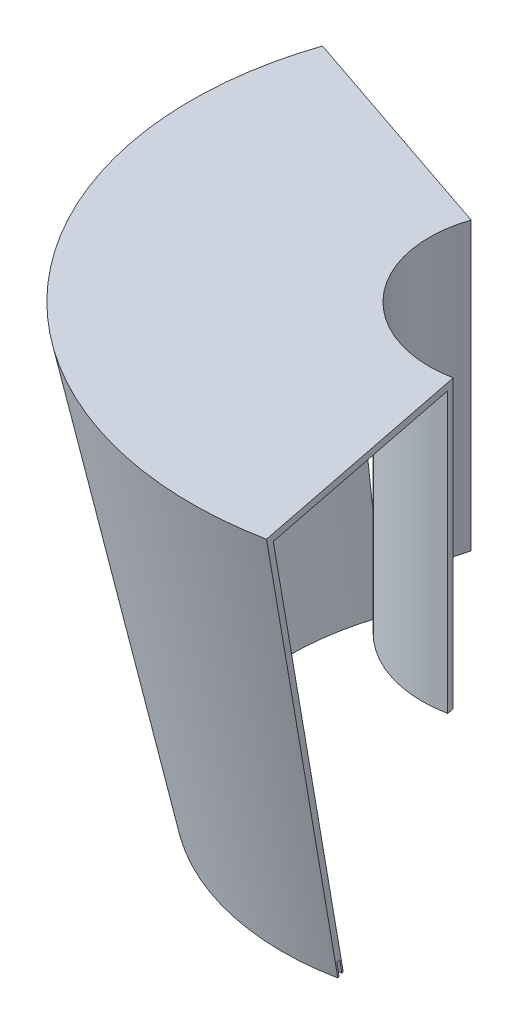
ISO-10303-21;
HEADER;
FILE_DESCRIPTION(('STEP AP214'),'2;1');
FILE_NAME('part.step','',(''),(''),'','','');
FILE_SCHEMA(('AUTOMOTIVE_DESIGN { 1 0 10303 214 1 1 1 1 }'));
ENDSEC;
DATA;
#1=APPLICATION_CONTEXT('core data for automotive mechanical design processes');
#2=APPLICATION_PROTOCOL_DEFINITION('international standard','automotive_design',2000,#1);
#3=PRODUCT_CONTEXT('',#1,'mechanical');
#4=PRODUCT('Part','Part','',(#3));
#5=PRODUCT_RELATED_PRODUCT_CATEGORY('part','',(#4));
#6=PRODUCT_DEFINITION_FORMATION('','',#4);
#7=PRODUCT_DEFINITION_CONTEXT('part definition',#1,'design');
#8=PRODUCT_DEFINITION('design','',#6,#7);
#9=PRODUCT_DEFINITION_SHAPE('','',#8);
#10=(LENGTH_UNIT() NAMED_UNIT(*) SI_UNIT(.MILLI.,.METRE.));
#11=(NAMED_UNIT(*) PLANE_ANGLE_UNIT() SI_UNIT($,.RADIAN.));
#12=(NAMED_UNIT(*) SI_UNIT($,.STERADIAN.) SOLID_ANGLE_UNIT());
#13=UNCERTAINTY_MEASURE_WITH_UNIT(LENGTH_MEASURE(1.E-05),#10,'distance_accuracy_value','');
#14=(GEOMETRIC_REPRESENTATION_CONTEXT(3) GLOBAL_UNCERTAINTY_ASSIGNED_CONTEXT((#13)) GLOBAL_UNIT_ASSIGNED_CONTEXT((#10,
#11,#12)) REPRESENTATION_CONTEXT('',''));
#15=CARTESIAN_POINT('',(0.,0.,0.));
#16=DIRECTION('',(0.,0.,1.));
#17=DIRECTION('',(1.,0.,0.));
#18=AXIS2_PLACEMENT_3D('',#15,#16,#17);
#19=CARTESIAN_POINT('',(0.,273.05,0.));
#20=DIRECTION('',(0.,-1.,0.));
#21=DIRECTION('',(0.,0.,-1.));
#22=AXIS2_PLACEMENT_3D('',#19,#20,#21);
#23=CONICAL_SURFACE('',#22,117.517905405405,1.36432189836919);
#24=DIRECTION('',(0.926817120685938,0.205010493456545,0.314612018804322));
#25=VECTOR('',#24,1.);
#26=CARTESIAN_POINT('',(0.,297.665236943026,0.));
#27=LINE('',#26,#25);
#28=CARTESIAN_POINT('',(-110.54558429399,273.212727079181,-37.5251693871339));
#29=VERTEX_POINT('',#28);
#30=CARTESIAN_POINT('',(-111.281245383534,273.05,-37.7748926770599));
#31=VERTEX_POINT('',#30);
#32=EDGE_CURVE('E11',#29,#31,#27,.F.);
#33=ORIENTED_EDGE('',*,*,#32,.F.);
#34=CARTESIAN_POINT('',(0.,273.212727079181,0.));
#35=DIRECTION('',(0.,-1.,0.));
#36=DIRECTION('',(0.,0.,-1.));
#37=AXIS2_PLACEMENT_3D('',#34,#35,#36);
#38=CIRCLE('',#37,116.741014833831);
#39=CARTESIAN_POINT('',(22.7750421764218,273.212727079181,114.497868968357));
#40=VERTEX_POINT('',#39);
#41=EDGE_CURVE('E138',#40,#29,#38,.T.);
#42=ORIENTED_EDGE('',*,*,#41,.F.);
#43=DIRECTION('',(-0.190946559722509,0.205010493456545,-0.959953180578534));
#44=VECTOR('',#43,1.);
#45=CARTESIAN_POINT('',(0.,297.665236943026,0.));
#46=LINE('',#45,#44);
#47=CARTESIAN_POINT('',(22.9266060082015,273.05,115.259831805441));
#48=VERTEX_POINT('',#47);
#49=EDGE_CURVE('E44',#40,#48,#46,.F.);
#50=ORIENTED_EDGE('',*,*,#49,.T.);
#51=CARTESIAN_POINT('',(0.,273.05,0.));
#52=DIRECTION('',(0.,-1.,0.));
#53=DIRECTION('',(0.,0.,-1.));
#54=AXIS2_PLACEMENT_3D('',#51,#52,#53);
#55=CIRCLE('',#54,117.517905405405);
#56=EDGE_CURVE('E132',#48,#31,#55,.T.);
#57=ORIENTED_EDGE('',*,*,#56,.T.);
#58=EDGE_LOOP('',(#33,#42,#50,#57));
#59=FACE_BOUND('',#58,.T.);
#60=ADVANCED_FACE('F36',(#59),#23,.F.);
#61=CARTESIAN_POINT('',(0.,273.212727079181,0.));
#62=DIRECTION('',(0.,1.,0.));
#63=DIRECTION('',(0.,0.,1.));
#64=AXIS2_PLACEMENT_3D('',#61,#62,#63);
#65=CONICAL_SURFACE('',#64,116.741014833831,0.20647442842569);
#66=DIRECTION('',(-0.19413061311665,0.978759775211829,-0.0658984633982029));
#67=VECTOR('',#66,1.);
#68=CARTESIAN_POINT('',(0.,-284.131472772656,0.));
#69=LINE('',#68,#67);
#70=CARTESIAN_POINT('',(-111.778313687281,279.427851651776,-37.9436246297125));
#71=VERTEX_POINT('',#70);
#72=EDGE_CURVE('E58',#71,#29,#69,.F.);
#73=ORIENTED_EDGE('',*,*,#72,.F.);
#74=CARTESIAN_POINT('',(0.,279.427851651776,0.));
#75=DIRECTION('',(0.,-1.,0.));
#76=DIRECTION('',(0.,0.,-1.));
#77=AXIS2_PLACEMENT_3D('',#74,#75,#76);
#78=CIRCLE('',#77,118.04283146728);
#79=CARTESIAN_POINT('',(23.0290140026473,279.427851651776,115.774671560227));
#80=VERTEX_POINT('',#79);
#81=EDGE_CURVE('E140',#80,#71,#78,.T.);
#82=ORIENTED_EDGE('',*,*,#81,.F.);
#83=DIRECTION('',(0.0399955631851203,0.978759775211829,0.201071274310369));
#84=VECTOR('',#83,1.);
#85=CARTESIAN_POINT('',(0.,-284.131472772656,0.));
#86=LINE('',#85,#84);
#87=EDGE_CURVE('E214',#80,#40,#86,.F.);
#88=ORIENTED_EDGE('',*,*,#87,.T.);
#89=ORIENTED_EDGE('',*,*,#41,.T.);
#90=EDGE_LOOP('',(#73,#82,#88,#89));
#91=FACE_BOUND('',#90,.T.);
#92=ADVANCED_FACE('F218',(#91),#65,.F.);
#93=CARTESIAN_POINT('',(0.,279.427851651776,0.));
#94=DIRECTION('',(0.,-1.,0.));
#95=DIRECTION('',(0.,0.,-1.));
#96=AXIS2_PLACEMENT_3D('',#93,#94,#95);
#97=CONICAL_SURFACE('',#96,118.04283146728,1.36432189836926);
#98=DIRECTION('',(0.926817120685951,0.205010493456478,0.314612018804327));
#99=VECTOR('',#98,1.);
#100=CARTESIAN_POINT('',(0.,304.15303932397,0.));
#101=LINE('',#100,#99);
#102=CARTESIAN_POINT('',(-110.306991508192,279.753305810138,-37.4441780498607));
#103=VERTEX_POINT('',#102);
#104=EDGE_CURVE('E186',#103,#71,#101,.F.);
#105=ORIENTED_EDGE('',*,*,#104,.F.);
#106=CARTESIAN_POINT('',(0.,279.753305810138,0.));
#107=DIRECTION('',(0.,-1.,0.));
#108=DIRECTION('',(0.,0.,-1.));
#109=AXIS2_PLACEMENT_3D('',#106,#107,#108);
#110=CIRCLE('',#109,116.489050324131);
#111=CARTESIAN_POINT('',(22.7258863390878,279.753305810138,114.250745886059));
#112=VERTEX_POINT('',#111);
#113=EDGE_CURVE('E145',#112,#103,#110,.T.);
#114=ORIENTED_EDGE('',*,*,#113,.F.);
#115=DIRECTION('',(-0.190946559722512,0.205010493456478,-0.959953180578547));
#116=VECTOR('',#115,1.);
#117=CARTESIAN_POINT('',(0.,304.15303932397,0.));
#118=LINE('',#117,#116);
#119=EDGE_CURVE('E211',#112,#80,#118,.F.);
#120=ORIENTED_EDGE('',*,*,#119,.T.);
#121=ORIENTED_EDGE('',*,*,#81,.T.);
#122=EDGE_LOOP('',(#105,#114,#120,#121));
#123=FACE_BOUND('',#122,.T.);
#124=ADVANCED_FACE('F223',(#123),#97,.F.);
#125=CARTESIAN_POINT('',(0.,279.753305810138,0.));
#126=DIRECTION('',(0.,1.,0.));
#127=DIRECTION('',(0.,0.,1.));
#128=AXIS2_PLACEMENT_3D('',#125,#126,#127);
#129=CONICAL_SURFACE('',#128,116.489050324131,0.206474428425689);
#130=DIRECTION('',(-0.194130613116649,0.978759775211829,-0.0658984633982026));
#131=VECTOR('',#130,1.);
#132=CARTESIAN_POINT('',(0.,-276.38796670507,0.));
#133=LINE('',#132,#131);
#134=CARTESIAN_POINT('',(-109.074262114901,273.538181237543,-37.0257228072821));
#135=VERTEX_POINT('',#134);
#136=EDGE_CURVE('E184',#135,#103,#133,.T.);
#137=ORIENTED_EDGE('',*,*,#136,.F.);
#138=CARTESIAN_POINT('',(0.,273.538181237543,0.));
#139=DIRECTION('',(0.,-1.,0.));
#140=DIRECTION('',(0.,0.,-1.));
#141=AXIS2_PLACEMENT_3D('',#138,#139,#140);
#142=CIRCLE('',#141,115.187233690682);
#143=CARTESIAN_POINT('',(22.4719145128623,273.538181237543,112.973943294188));
#144=VERTEX_POINT('',#143);
#145=EDGE_CURVE('E148',#144,#135,#142,.T.);
#146=ORIENTED_EDGE('',*,*,#145,.F.);
#147=DIRECTION('',(0.0399955631851201,0.978759775211829,0.201071274310368));
#148=VECTOR('',#147,1.);
#149=CARTESIAN_POINT('',(0.,-276.38796670507,0.));
#150=LINE('',#149,#148);
#151=EDGE_CURVE('E208',#144,#112,#150,.T.);
#152=ORIENTED_EDGE('',*,*,#151,.T.);
#153=ORIENTED_EDGE('',*,*,#113,.T.);
#154=EDGE_LOOP('',(#137,#146,#152,#153));
#155=FACE_BOUND('',#154,.T.);
#156=ADVANCED_FACE('F226',(#155),#129,.T.);
#157=CARTESIAN_POINT('',(0.,273.538181237543,0.));
#158=DIRECTION('',(0.,-1.,0.));
#159=DIRECTION('',(0.,0.,-1.));
#160=AXIS2_PLACEMENT_3D('',#157,#158,#159);
#161=CONICAL_SURFACE('',#160,115.187233690682,1.36432189836933);
#162=DIRECTION('',(0.926817120685964,0.205010493456414,0.314612018804331));
#163=VECTOR('',#162,1.);
#164=CARTESIAN_POINT('',(0.,297.66523694301,0.));
#165=LINE('',#164,#163);
#166=CARTESIAN_POINT('',(-108.338601025357,273.700908316724,-36.7759995173562));
#167=VERTEX_POINT('',#166);
#168=EDGE_CURVE('E182',#167,#135,#165,.F.);
#169=ORIENTED_EDGE('',*,*,#168,.F.);
#170=CARTESIAN_POINT('',(0.,273.700908316724,0.));
#171=DIRECTION('',(0.,-1.,0.));
#172=DIRECTION('',(0.,0.,-1.));
#173=AXIS2_PLACEMENT_3D('',#170,#171,#172);
#174=CIRCLE('',#173,114.410343119108);
#175=CARTESIAN_POINT('',(22.3203506810826,273.700908316724,112.211980457104));
#176=VERTEX_POINT('',#175);
#177=EDGE_CURVE('E152',#176,#167,#174,.T.);
#178=ORIENTED_EDGE('',*,*,#177,.F.);
#179=DIRECTION('',(-0.190946559722514,0.205010493456414,-0.95995318057856));
#180=VECTOR('',#179,1.);
#181=CARTESIAN_POINT('',(0.,297.66523694301,0.));
#182=LINE('',#181,#180);
#183=EDGE_CURVE('E205',#176,#144,#182,.F.);
#184=ORIENTED_EDGE('',*,*,#183,.T.);
#185=ORIENTED_EDGE('',*,*,#145,.T.);
#186=EDGE_LOOP('',(#169,#178,#184,#185));
#187=FACE_BOUND('',#186,.T.);
#188=ADVANCED_FACE('F231',(#187),#161,.F.);
#189=CARTESIAN_POINT('',(0.,-3.175,0.));
#190=DIRECTION('',(0.,1.,0.));
#191=DIRECTION('',(0.,0.,1.));
#192=AXIS2_PLACEMENT_3D('',#189,#190,#191);
#193=CONICAL_SURFACE('',#192,56.4160650257399,0.20647442842569);
#194=DIRECTION('',(-0.19413061311665,0.978759775211829,-0.0658984633982028));
#195=VECTOR('',#194,1.);
#196=CARTESIAN_POINT('',(0.,-272.516213671274,0.));
#197=LINE('',#196,#195);
#198=CARTESIAN_POINT('',(-146.623669755984,466.725,-49.7720291488444));
#199=VERTEX_POINT('',#198);
#200=EDGE_CURVE('E180',#199,#167,#197,.F.);
#201=ORIENTED_EDGE('',*,*,#200,.F.);
#202=CARTESIAN_POINT('',(0.,466.725,0.));
#203=DIRECTION('',(0.,-1.,0.));
#204=DIRECTION('',(0.,0.,-1.));
#205=AXIS2_PLACEMENT_3D('',#202,#203,#204);
#206=CIRCLE('',#205,154.84106502574);
#207=CARTESIAN_POINT('',(30.2079932371919,466.725,151.865837379205));
#208=VERTEX_POINT('',#207);
#209=EDGE_CURVE('E156',#208,#199,#206,.T.);
#210=ORIENTED_EDGE('',*,*,#209,.F.);
#211=DIRECTION('',(0.0399955631851203,0.978759775211829,0.201071274310369));
#212=VECTOR('',#211,1.);
#213=CARTESIAN_POINT('',(0.,-272.516213671274,0.));
#214=LINE('',#213,#212);
#215=EDGE_CURVE('E202',#208,#176,#214,.F.);
#216=ORIENTED_EDGE('',*,*,#215,.T.);
#217=ORIENTED_EDGE('',*,*,#177,.T.);
#218=EDGE_LOOP('',(#201,#210,#216,#217));
#219=FACE_BOUND('',#218,.T.);
#220=ADVANCED_FACE('F234',(#219),#193,.F.);
#221=CARTESIAN_POINT('',(0.,339.725,0.));
#222=DIRECTION('',(0.,-1.,0.));
#223=DIRECTION('',(0.,0.,-1.));
#224=AXIS2_PLACEMENT_3D('',#221,#222,#223);
#225=PLANE('',#224);
#226=CARTESIAN_POINT('',(0.,339.725,0.));
#227=DIRECTION('',(0.,-1.,0.));
#228=DIRECTION('',(0.,0.,-1.));
#229=AXIS2_PLACEMENT_3D('',#226,#227,#228);
#230=CIRCLE('',#229,53.975);
#231=CARTESIAN_POINT('',(10.5300001308206,339.725,52.9378855097643));
#232=VERTEX_POINT('',#231);
#233=CARTESIAN_POINT('',(-51.1105537394985,339.725,-17.3496951397376));
#234=VERTEX_POINT('',#233);
#235=EDGE_CURVE('E151',#232,#234,#230,.T.);
#236=ORIENTED_EDGE('',*,*,#235,.T.);
#237=DIRECTION('',(0.946930129495109,0.,0.321439465303152));
#238=VECTOR('',#237,1.);
#239=CARTESIAN_POINT('',(0.,339.725,0.));
#240=LINE('',#239,#238);
#241=CARTESIAN_POINT('',(-48.1040505783515,339.725,-16.3291248374001));
#242=VERTEX_POINT('',#241);
#243=EDGE_CURVE('E173',#234,#242,#240,.T.);
#244=ORIENTED_EDGE('',*,*,#243,.T.);
#245=CARTESIAN_POINT('',(0.,339.725,0.));
#246=DIRECTION('',(0.,-1.,0.));
#247=DIRECTION('',(0.,0.,-1.));
#248=AXIS2_PLACEMENT_3D('',#245,#246,#247);
#249=CIRCLE('',#248,50.8);
#250=CARTESIAN_POINT('',(9.91058835841935,339.725,49.8238922444841));
#251=VERTEX_POINT('',#250);
#252=EDGE_CURVE('E157',#242,#251,#249,.F.);
#253=ORIENTED_EDGE('',*,*,#252,.T.);
#254=DIRECTION('',(-0.195090322016129,0.,-0.98078528040323));
#255=VECTOR('',#254,1.);
#256=CARTESIAN_POINT('',(0.,339.725,0.));
#257=LINE('',#256,#255);
#258=EDGE_CURVE('E191',#232,#251,#257,.T.);
#259=ORIENTED_EDGE('',*,*,#258,.F.);
#260=EDGE_LOOP('',(#236,#244,#253,#259));
#261=FACE_BOUND('',#260,.T.);
#262=ADVANCED_FACE('F247',(#261),#225,.T.);
#263=CARTESIAN_POINT('',(0.,339.725,0.));
#264=DIRECTION('',(0.,1.,0.));
#265=DIRECTION('',(0.,0.,1.));
#266=AXIS2_PLACEMENT_3D('',#263,#264,#265);
#267=CYLINDRICAL_SURFACE('',#266,53.975);
#268=DIRECTION('',(0.,1.,0.));
#269=VECTOR('',#268,1.);
#270=CARTESIAN_POINT('',(-51.1105537394985,339.725,-17.3496951397376));
#271=LINE('',#270,#269);
#272=CARTESIAN_POINT('',(-51.1105537394985,466.725,-17.3496951397376));
#273=VERTEX_POINT('',#272);
#274=EDGE_CURVE('E135',#234,#273,#271,.T.);
#275=ORIENTED_EDGE('',*,*,#274,.F.);
#276=ORIENTED_EDGE('',*,*,#235,.F.);
#277=DIRECTION('',(0.,1.,0.));
#278=VECTOR('',#277,1.);
#279=CARTESIAN_POINT('',(10.5300001308206,339.725,52.9378855097643));
#280=LINE('',#279,#278);
#281=CARTESIAN_POINT('',(10.5300001308206,466.725,52.9378855097644));
#282=VERTEX_POINT('',#281);
#283=EDGE_CURVE('E195',#232,#282,#280,.T.);
#284=ORIENTED_EDGE('',*,*,#283,.T.);
#285=CARTESIAN_POINT('',(0.,466.725,0.));
#286=DIRECTION('',(0.,1.,0.));
#287=DIRECTION('',(0.,0.,1.));
#288=AXIS2_PLACEMENT_3D('',#285,#286,#287);
#289=CIRCLE('',#288,53.975);
#290=EDGE_CURVE('E160',#282,#273,#289,.F.);
#291=ORIENTED_EDGE('',*,*,#290,.T.);
#292=EDGE_LOOP('',(#275,#276,#284,#291));
#293=FACE_BOUND('',#292,.T.);
#294=ADVANCED_FACE('F242',(#293),#267,.T.);
#295=CARTESIAN_POINT('',(0.,0.,0.));
#296=DIRECTION('',(0.,-1.,0.));
#297=DIRECTION('',(0.,0.,-1.));
#298=AXIS2_PLACEMENT_3D('',#295,#296,#297);
#299=CYLINDRICAL_SURFACE('',#298,50.8);
#300=ORIENTED_EDGE('',*,*,#252,.F.);
#301=DIRECTION('',(0.,-1.,0.));
#302=VECTOR('',#301,1.);
#303=CARTESIAN_POINT('',(-48.1040505783515,0.,-16.3291248374001));
#304=LINE('',#303,#302);
#305=CARTESIAN_POINT('',(-48.1040505783515,469.9,-16.3291248374001));
#306=VERTEX_POINT('',#305);
#307=EDGE_CURVE('E166',#242,#306,#304,.F.);
#308=ORIENTED_EDGE('',*,*,#307,.T.);
#309=CARTESIAN_POINT('',(0.,469.9,0.));
#310=DIRECTION('',(0.,-1.,0.));
#311=DIRECTION('',(0.,0.,-1.));
#312=AXIS2_PLACEMENT_3D('',#309,#310,#311);
#313=CIRCLE('',#312,50.8);
#314=CARTESIAN_POINT('',(9.91058835841934,469.9,49.8238922444841));
#315=VERTEX_POINT('',#314);
#316=EDGE_CURVE('E155',#315,#306,#313,.T.);
#317=ORIENTED_EDGE('',*,*,#316,.F.);
#318=DIRECTION('',(0.,-1.,0.));
#319=VECTOR('',#318,1.);
#320=CARTESIAN_POINT('',(9.91058835841935,0.,49.8238922444841));
#321=LINE('',#320,#319);
#322=EDGE_CURVE('E189',#251,#315,#321,.F.);
#323=ORIENTED_EDGE('',*,*,#322,.F.);
#324=EDGE_LOOP('',(#300,#308,#317,#323));
#325=FACE_BOUND('',#324,.T.);
#326=ADVANCED_FACE('F250',(#325),#299,.F.);
#327=CARTESIAN_POINT('',(-158.75,469.9,0.));
#328=DIRECTION('',(0.,1.,0.));
#329=DIRECTION('',(0.,0.,1.));
#330=AXIS2_PLACEMENT_3D('',#327,#328,#329);
#331=PLANE('',#330);
#332=ORIENTED_EDGE('',*,*,#316,.T.);
#333=DIRECTION('',(-0.946930129495109,0.,-0.321439465303152));
#334=VECTOR('',#333,1.);
#335=CARTESIAN_POINT('',(-142.347421385618,469.9,-48.3204384275659));
#336=LINE('',#335,#334);
#337=CARTESIAN_POINT('',(-150.325158057349,469.9,-51.0285151168753));
#338=VERTEX_POINT('',#337);
#339=EDGE_CURVE('E176',#306,#338,#336,.T.);
#340=ORIENTED_EDGE('',*,*,#339,.T.);
#341=CARTESIAN_POINT('',(0.,469.9,0.));
#342=DIRECTION('',(0.,-1.,0.));
#343=DIRECTION('',(0.,0.,-1.));
#344=AXIS2_PLACEMENT_3D('',#341,#342,#343);
#345=CIRCLE('',#344,158.75);
#346=CARTESIAN_POINT('',(30.9705886200605,469.9,155.699663264013));
#347=VERTEX_POINT('',#346);
#348=EDGE_CURVE('E134',#347,#338,#345,.T.);
#349=ORIENTED_EDGE('',*,*,#348,.F.);
#350=DIRECTION('',(0.195090322016129,0.,0.98078528040323));
#351=VECTOR('',#350,1.);
#352=CARTESIAN_POINT('',(-6.04206210691666,469.9,-30.3754974439791));
#353=LINE('',#352,#351);
#354=EDGE_CURVE('E193',#315,#347,#353,.T.);
#355=ORIENTED_EDGE('',*,*,#354,.F.);
#356=EDGE_LOOP('',(#332,#340,#349,#355));
#357=FACE_BOUND('',#356,.T.);
#358=ADVANCED_FACE('F254',(#357),#331,.T.);
#359=CARTESIAN_POINT('',(-158.75,466.725,0.));
#360=DIRECTION('',(0.,1.,0.));
#361=DIRECTION('',(0.,0.,1.));
#362=AXIS2_PLACEMENT_3D('',#359,#360,#361);
#363=PLANE('',#362);
#364=DIRECTION('',(-0.946930129495109,0.,-0.321439465303152));
#365=VECTOR('',#364,1.);
#366=CARTESIAN_POINT('',(-142.347421385618,466.725,-48.3204384275659));
#367=LINE('',#366,#365);
#368=EDGE_CURVE('E136',#273,#199,#367,.T.);
#369=ORIENTED_EDGE('',*,*,#368,.F.);
#370=ORIENTED_EDGE('',*,*,#290,.F.);
#371=DIRECTION('',(0.195090322016129,0.,0.98078528040323));
#372=VECTOR('',#371,1.);
#373=CARTESIAN_POINT('',(-6.04206210691666,466.725,-30.3754974439791));
#374=LINE('',#373,#372);
#375=EDGE_CURVE('E199',#282,#208,#374,.T.);
#376=ORIENTED_EDGE('',*,*,#375,.T.);
#377=ORIENTED_EDGE('',*,*,#209,.T.);
#378=EDGE_LOOP('',(#369,#370,#376,#377));
#379=FACE_BOUND('',#378,.T.);
#380=ADVANCED_FACE('F239',(#379),#363,.F.);
#381=CARTESIAN_POINT('',(0.,0.,0.));
#382=DIRECTION('',(0.,1.,0.));
#383=DIRECTION('',(0.,0.,1.));
#384=AXIS2_PLACEMENT_3D('',#381,#382,#383);
#385=CONICAL_SURFACE('',#384,60.325,0.20647442842569);
#386=ORIENTED_EDGE('',*,*,#348,.T.);
#387=DIRECTION('',(-0.19413061311665,0.978759775211829,-0.0658984633982028));
#388=VECTOR('',#387,1.);
#389=CARTESIAN_POINT('',(0.,-288.003225806452,0.));
#390=LINE('',#389,#388);
#391=EDGE_CURVE('E123',#338,#31,#390,.F.);
#392=ORIENTED_EDGE('',*,*,#391,.T.);
#393=ORIENTED_EDGE('',*,*,#56,.F.);
#394=DIRECTION('',(0.0399955631851203,0.978759775211829,0.201071274310369));
#395=VECTOR('',#394,1.);
#396=CARTESIAN_POINT('',(0.,-288.003225806452,0.));
#397=LINE('',#396,#395);
#398=EDGE_CURVE('E51',#347,#48,#397,.F.);
#399=ORIENTED_EDGE('',*,*,#398,.F.);
#400=EDGE_LOOP('',(#386,#392,#393,#399));
#401=FACE_BOUND('',#400,.T.);
#402=ADVANCED_FACE('F38',(#401),#385,.T.);
#403=CARTESIAN_POINT('',(0.,273.05,0.));
#404=DIRECTION('',(-0.98078528040323,0.,0.195090322016129));
#405=DIRECTION('',(0.195090322016129,0.,0.98078528040323));
#406=AXIS2_PLACEMENT_3D('',#403,#404,#405);
#407=PLANE('',#406);
#408=ORIENTED_EDGE('',*,*,#322,.T.);
#409=ORIENTED_EDGE('',*,*,#354,.T.);
#410=ORIENTED_EDGE('',*,*,#398,.T.);
#411=ORIENTED_EDGE('',*,*,#49,.F.);
#412=ORIENTED_EDGE('',*,*,#87,.F.);
#413=ORIENTED_EDGE('',*,*,#119,.F.);
#414=ORIENTED_EDGE('',*,*,#151,.F.);
#415=ORIENTED_EDGE('',*,*,#183,.F.);
#416=ORIENTED_EDGE('',*,*,#215,.F.);
#417=ORIENTED_EDGE('',*,*,#375,.F.);
#418=ORIENTED_EDGE('',*,*,#283,.F.);
#419=ORIENTED_EDGE('',*,*,#258,.T.);
#420=EDGE_LOOP('',(#408,#409,#410,#411,#412,#413,#414,#415,#416,#417,#418,#419));
#421=FACE_BOUND('',#420,.T.);
#422=ADVANCED_FACE('F219',(#421),#407,.F.);
#423=CARTESIAN_POINT('',(0.,273.05,0.));
#424=DIRECTION('',(0.321439465303152,0.,-0.946930129495109));
#425=DIRECTION('',(-0.946930129495109,0.,-0.321439465303152));
#426=AXIS2_PLACEMENT_3D('',#423,#424,#425);
#427=PLANE('',#426);
#428=ORIENTED_EDGE('',*,*,#243,.F.);
#429=ORIENTED_EDGE('',*,*,#274,.T.);
#430=ORIENTED_EDGE('',*,*,#368,.T.);
#431=ORIENTED_EDGE('',*,*,#200,.T.);
#432=ORIENTED_EDGE('',*,*,#168,.T.);
#433=ORIENTED_EDGE('',*,*,#136,.T.);
#434=ORIENTED_EDGE('',*,*,#104,.T.);
#435=ORIENTED_EDGE('',*,*,#72,.T.);
#436=ORIENTED_EDGE('',*,*,#32,.T.);
#437=ORIENTED_EDGE('',*,*,#391,.F.);
#438=ORIENTED_EDGE('',*,*,#339,.F.);
#439=ORIENTED_EDGE('',*,*,#307,.F.);
#440=EDGE_LOOP('',(#428,#429,#430,#431,#432,#433,#434,#435,#436,#437,#438,#439));
#441=FACE_BOUND('',#440,.T.);
#442=ADVANCED_FACE('F122',(#441),#427,.T.);
#443=CLOSED_SHELL('',(#60,#92,#124,#156,#188,#220,#262,#294,#326,#358,#380,#402,#422,#442));
#444=MANIFOLD_SOLID_BREP('B2',#443);
#445=ADVANCED_BREP_SHAPE_REPRESENTATION('',(#18,#444),#14);
#446=SHAPE_DEFINITION_REPRESENTATION(#9,#445);
ENDSEC;
END-ISO-10303-21;
